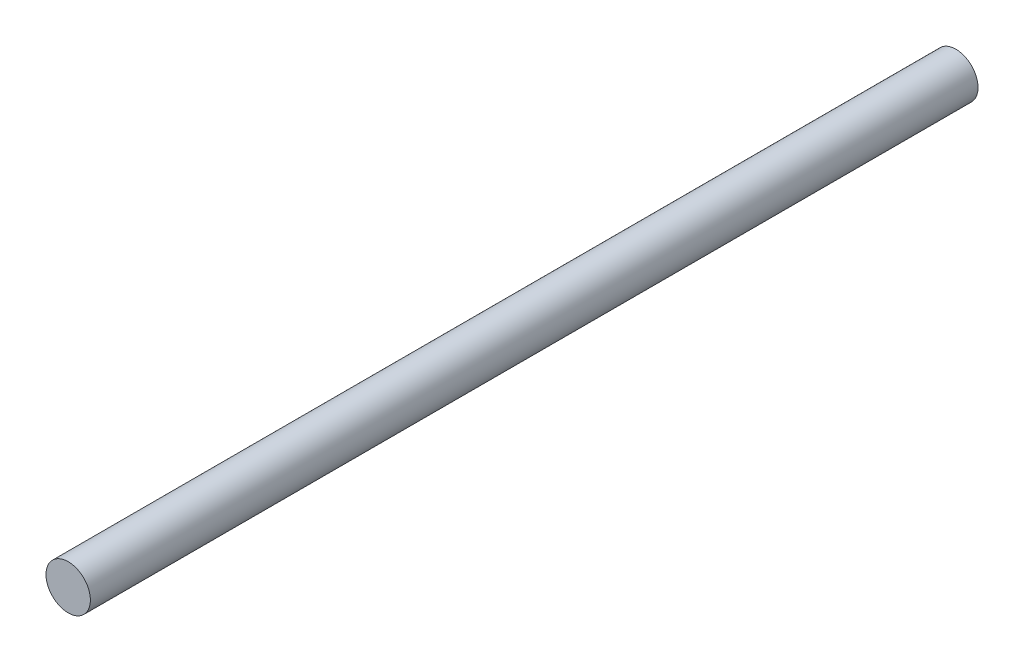
ISO-10303-21;
HEADER;
FILE_DESCRIPTION(('STEP AP214'),'2;1');
FILE_NAME('part.step','',(''),(''),'','','');
FILE_SCHEMA(('AUTOMOTIVE_DESIGN { 1 0 10303 214 1 1 1 1 }'));
ENDSEC;
DATA;
#1=APPLICATION_CONTEXT('core data for automotive mechanical design processes');
#2=APPLICATION_PROTOCOL_DEFINITION('international standard','automotive_design',2000,#1);
#3=PRODUCT_CONTEXT('',#1,'mechanical');
#4=PRODUCT('Part','Part','',(#3));
#5=PRODUCT_RELATED_PRODUCT_CATEGORY('part','',(#4));
#6=PRODUCT_DEFINITION_FORMATION('','',#4);
#7=PRODUCT_DEFINITION_CONTEXT('part definition',#1,'design');
#8=PRODUCT_DEFINITION('design','',#6,#7);
#9=PRODUCT_DEFINITION_SHAPE('','',#8);
#10=(LENGTH_UNIT() NAMED_UNIT(*) SI_UNIT(.MILLI.,.METRE.));
#11=(NAMED_UNIT(*) PLANE_ANGLE_UNIT() SI_UNIT($,.RADIAN.));
#12=(NAMED_UNIT(*) SI_UNIT($,.STERADIAN.) SOLID_ANGLE_UNIT());
#13=UNCERTAINTY_MEASURE_WITH_UNIT(LENGTH_MEASURE(1.E-05),#10,'distance_accuracy_value','');
#14=(GEOMETRIC_REPRESENTATION_CONTEXT(3) GLOBAL_UNCERTAINTY_ASSIGNED_CONTEXT((#13)) GLOBAL_UNIT_ASSIGNED_CONTEXT((#10,
#11,#12)) REPRESENTATION_CONTEXT('',''));
#15=CARTESIAN_POINT('',(0.,0.,0.));
#16=DIRECTION('',(0.,0.,1.));
#17=DIRECTION('',(1.,0.,0.));
#18=AXIS2_PLACEMENT_3D('',#15,#16,#17);
#19=CARTESIAN_POINT('',(0.,0.,63.5));
#20=DIRECTION('',(0.,0.,-1.));
#21=DIRECTION('',(-1.,0.,0.));
#22=AXIS2_PLACEMENT_3D('',#19,#20,#21);
#23=CYLINDRICAL_SURFACE('',#22,1.5875);
#24=CARTESIAN_POINT('',(0.,0.,63.5));
#25=DIRECTION('',(0.,0.,-1.));
#26=DIRECTION('',(-1.,0.,0.));
#27=AXIS2_PLACEMENT_3D('',#24,#25,#26);
#28=CIRCLE('',#27,1.5875);
#29=CARTESIAN_POINT('',(-1.5875,0.,63.5));
#30=VERTEX_POINT('',#29);
#31=EDGE_CURVE('E10',#30,#30,#28,.T.);
#32=ORIENTED_EDGE('',*,*,#31,.T.);
#33=EDGE_LOOP('',(#32));
#34=FACE_BOUND('',#33,.T.);
#35=CARTESIAN_POINT('',(0.,0.,0.));
#36=DIRECTION('',(0.,0.,-1.));
#37=DIRECTION('',(-1.,0.,0.));
#38=AXIS2_PLACEMENT_3D('',#35,#36,#37);
#39=CIRCLE('',#38,1.5875);
#40=CARTESIAN_POINT('',(-1.5875,0.,0.));
#41=VERTEX_POINT('',#40);
#42=EDGE_CURVE('E36',#41,#41,#39,.T.);
#43=ORIENTED_EDGE('',*,*,#42,.F.);
#44=EDGE_LOOP('',(#43));
#45=FACE_BOUND('',#44,.T.);
#46=ADVANCED_FACE('F30',(#34,#45),#23,.T.);
#47=CARTESIAN_POINT('',(1.5875,0.,63.5));
#48=DIRECTION('',(0.,0.,1.));
#49=DIRECTION('',(1.,0.,0.));
#50=AXIS2_PLACEMENT_3D('',#47,#48,#49);
#51=PLANE('',#50);
#52=ORIENTED_EDGE('',*,*,#31,.F.);
#53=EDGE_LOOP('',(#52));
#54=FACE_BOUND('',#53,.T.);
#55=ADVANCED_FACE('F45',(#54),#51,.T.);
#56=CARTESIAN_POINT('',(0.,0.,0.));
#57=DIRECTION('',(0.,0.,-1.));
#58=DIRECTION('',(-1.,0.,0.));
#59=AXIS2_PLACEMENT_3D('',#56,#57,#58);
#60=PLANE('',#59);
#61=ORIENTED_EDGE('',*,*,#42,.T.);
#62=EDGE_LOOP('',(#61));
#63=FACE_BOUND('',#62,.T.);
#64=ADVANCED_FACE('F42',(#63),#60,.T.);
#65=CLOSED_SHELL('',(#46,#55,#64));
#66=MANIFOLD_SOLID_BREP('B2',#65);
#67=ADVANCED_BREP_SHAPE_REPRESENTATION('',(#18,#66),#14);
#68=SHAPE_DEFINITION_REPRESENTATION(#9,#67);
ENDSEC;
END-ISO-10303-21;
